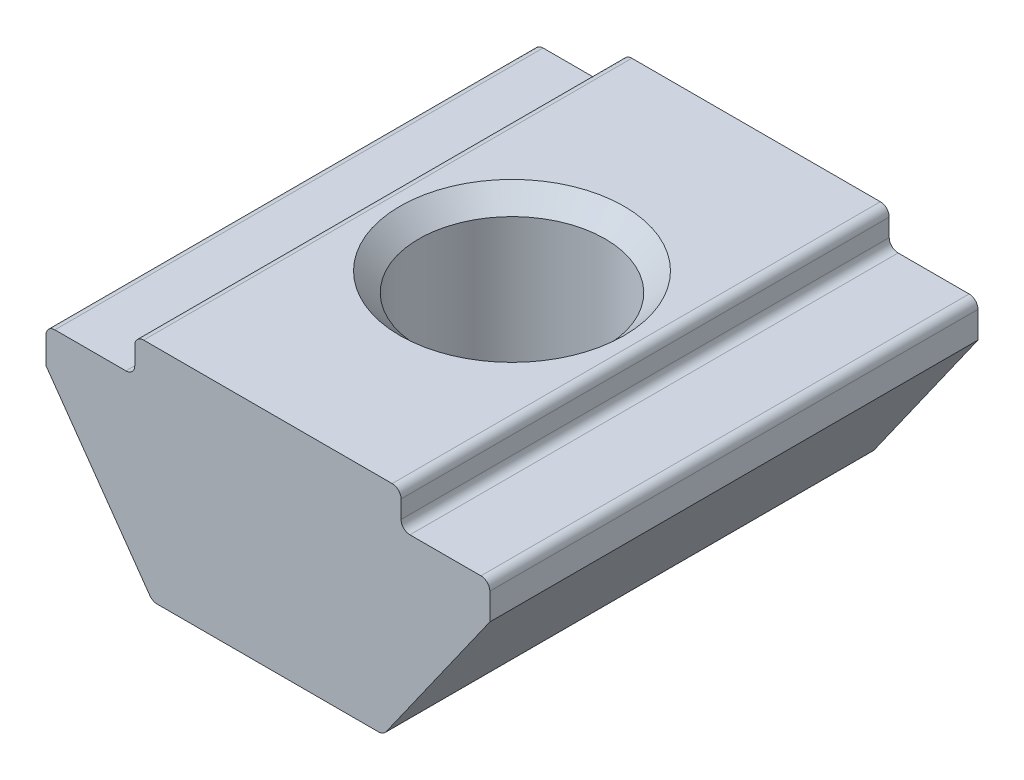
ISO-10303-21;
HEADER;
FILE_DESCRIPTION(('STEP AP214'),'2;1');
FILE_NAME('part.step','',(''),(''),'','','');
FILE_SCHEMA(('AUTOMOTIVE_DESIGN { 1 0 10303 214 1 1 1 1 }'));
ENDSEC;
DATA;
#1=APPLICATION_CONTEXT('core data for automotive mechanical design processes');
#2=APPLICATION_PROTOCOL_DEFINITION('international standard','automotive_design',2000,#1);
#3=PRODUCT_CONTEXT('',#1,'mechanical');
#4=PRODUCT('Part','Part','',(#3));
#5=PRODUCT_RELATED_PRODUCT_CATEGORY('part','',(#4));
#6=PRODUCT_DEFINITION_FORMATION('','',#4);
#7=PRODUCT_DEFINITION_CONTEXT('part definition',#1,'design');
#8=PRODUCT_DEFINITION('design','',#6,#7);
#9=PRODUCT_DEFINITION_SHAPE('','',#8);
#10=(LENGTH_UNIT() NAMED_UNIT(*) SI_UNIT(.MILLI.,.METRE.));
#11=(NAMED_UNIT(*) PLANE_ANGLE_UNIT() SI_UNIT($,.RADIAN.));
#12=(NAMED_UNIT(*) SI_UNIT($,.STERADIAN.) SOLID_ANGLE_UNIT());
#13=UNCERTAINTY_MEASURE_WITH_UNIT(LENGTH_MEASURE(1.E-05),#10,'distance_accuracy_value','');
#14=(GEOMETRIC_REPRESENTATION_CONTEXT(3) GLOBAL_UNCERTAINTY_ASSIGNED_CONTEXT((#13)) GLOBAL_UNIT_ASSIGNED_CONTEXT((#10,
#11,#12)) REPRESENTATION_CONTEXT('',''));
#15=CARTESIAN_POINT('',(0.,0.,0.));
#16=DIRECTION('',(0.,0.,1.));
#17=DIRECTION('',(1.,0.,0.));
#18=AXIS2_PLACEMENT_3D('',#15,#16,#17);
#19=CARTESIAN_POINT('',(-2.6,-5.,5.5));
#20=DIRECTION('',(0.,1.,0.));
#21=DIRECTION('',(0.,0.,1.));
#22=AXIS2_PLACEMENT_3D('',#19,#20,#21);
#23=PLANE('',#22);
#24=DIRECTION('',(1.,0.,0.));
#25=VECTOR('',#24,1.);
#26=CARTESIAN_POINT('',(-2.6,-5.,-5.5));
#27=LINE('',#26,#25);
#28=CARTESIAN_POINT('',(-2.49636879945077,-5.,-5.5));
#29=VERTEX_POINT('',#28);
#30=CARTESIAN_POINT('',(2.49636879945077,-5.,-5.5));
#31=VERTEX_POINT('',#30);
#32=EDGE_CURVE('E230',#29,#31,#27,.T.);
#33=ORIENTED_EDGE('',*,*,#32,.T.);
#34=DIRECTION('',(0.,0.,-1.));
#35=VECTOR('',#34,1.);
#36=CARTESIAN_POINT('',(2.49636879945077,-5.,5.5));
#37=LINE('',#36,#35);
#38=CARTESIAN_POINT('',(2.49636879945077,-5.,-0.37916726800811));
#39=VERTEX_POINT('',#38);
#40=EDGE_CURVE('E270',#31,#39,#37,.F.);
#41=ORIENTED_EDGE('',*,*,#40,.T.);
#42=CARTESIAN_POINT('',(0.,-5.,0.));
#43=DIRECTION('',(0.,1.,0.));
#44=DIRECTION('',(0.,0.,1.));
#45=AXIS2_PLACEMENT_3D('',#42,#43,#44);
#46=CIRCLE('',#45,2.525);
#47=CARTESIAN_POINT('',(-2.49636879945077,-5.,-0.379167268008107));
#48=VERTEX_POINT('',#47);
#49=EDGE_CURVE('E432',#39,#48,#46,.T.);
#50=ORIENTED_EDGE('',*,*,#49,.T.);
#51=DIRECTION('',(0.,0.,-1.));
#52=VECTOR('',#51,1.);
#53=CARTESIAN_POINT('',(-2.49636879945077,-5.,5.5));
#54=LINE('',#53,#52);
#55=EDGE_CURVE('E263',#48,#29,#54,.T.);
#56=ORIENTED_EDGE('',*,*,#55,.T.);
#57=EDGE_LOOP('',(#33,#41,#50,#56));
#58=FACE_BOUND('',#57,.T.);
#59=ADVANCED_FACE('F37',(#58),#23,.F.);
#60=CARTESIAN_POINT('',(-3.00000000000001,0.,5.5));
#61=DIRECTION('',(1.,0.,0.));
#62=DIRECTION('',(0.,1.,0.));
#63=AXIS2_PLACEMENT_3D('',#60,#61,#62);
#64=PLANE('',#63);
#65=DIRECTION('',(0.,-1.,0.));
#66=VECTOR('',#65,1.);
#67=CARTESIAN_POINT('',(-3.00000000000001,0.,5.5));
#68=LINE('',#67,#66);
#69=CARTESIAN_POINT('',(-3.,-0.200000000000002,5.5));
#70=VERTEX_POINT('',#69);
#71=CARTESIAN_POINT('',(-3.,-0.599999999999998,5.5));
#72=VERTEX_POINT('',#71);
#73=EDGE_CURVE('E246',#70,#72,#68,.T.);
#74=ORIENTED_EDGE('',*,*,#73,.F.);
#75=DIRECTION('',(0.,0.,-1.));
#76=VECTOR('',#75,1.);
#77=CARTESIAN_POINT('',(-3.,-0.200000000000002,5.5));
#78=LINE('',#77,#76);
#79=CARTESIAN_POINT('',(-3.,-0.200000000000002,-5.5));
#80=VERTEX_POINT('',#79);
#81=EDGE_CURVE('E397',#70,#80,#78,.T.);
#82=ORIENTED_EDGE('',*,*,#81,.T.);
#83=DIRECTION('',(0.,-1.,0.));
#84=VECTOR('',#83,1.);
#85=CARTESIAN_POINT('',(-3.00000000000001,0.,-5.5));
#86=LINE('',#85,#84);
#87=CARTESIAN_POINT('',(-3.,-0.599999999999998,-5.5));
#88=VERTEX_POINT('',#87);
#89=EDGE_CURVE('E220',#80,#88,#86,.T.);
#90=ORIENTED_EDGE('',*,*,#89,.T.);
#91=DIRECTION('',(0.,0.,-1.));
#92=VECTOR('',#91,1.);
#93=CARTESIAN_POINT('',(-3.,-0.599999999999998,5.5));
#94=LINE('',#93,#92);
#95=EDGE_CURVE('E395',#88,#72,#94,.F.);
#96=ORIENTED_EDGE('',*,*,#95,.T.);
#97=EDGE_LOOP('',(#74,#82,#90,#96));
#98=FACE_BOUND('',#97,.T.);
#99=ADVANCED_FACE('F336',(#98),#64,.F.);
#100=CARTESIAN_POINT('',(-3.,-0.799999999999999,5.5));
#101=DIRECTION('',(0.,-1.,0.));
#102=DIRECTION('',(1.,0.,0.));
#103=AXIS2_PLACEMENT_3D('',#100,#101,#102);
#104=PLANE('',#103);
#105=DIRECTION('',(-1.,0.,0.));
#106=VECTOR('',#105,1.);
#107=CARTESIAN_POINT('',(-3.,-0.799999999999999,-5.5));
#108=LINE('',#107,#106);
#109=CARTESIAN_POINT('',(-3.2,-0.799999999999999,-5.5));
#110=VERTEX_POINT('',#109);
#111=CARTESIAN_POINT('',(-4.8,-0.8,-5.5));
#112=VERTEX_POINT('',#111);
#113=EDGE_CURVE('E223',#110,#112,#108,.T.);
#114=ORIENTED_EDGE('',*,*,#113,.T.);
#115=DIRECTION('',(0.,0.,-1.));
#116=VECTOR('',#115,1.);
#117=CARTESIAN_POINT('',(-4.8,-0.8,5.5));
#118=LINE('',#117,#116);
#119=CARTESIAN_POINT('',(-4.8,-0.8,5.5));
#120=VERTEX_POINT('',#119);
#121=EDGE_CURVE('E405',#112,#120,#118,.F.);
#122=ORIENTED_EDGE('',*,*,#121,.T.);
#123=DIRECTION('',(-1.,0.,0.));
#124=VECTOR('',#123,1.);
#125=CARTESIAN_POINT('',(-3.,-0.799999999999999,5.5));
#126=LINE('',#125,#124);
#127=CARTESIAN_POINT('',(-3.2,-0.799999999999999,5.5));
#128=VERTEX_POINT('',#127);
#129=EDGE_CURVE('E187',#128,#120,#126,.T.);
#130=ORIENTED_EDGE('',*,*,#129,.F.);
#131=DIRECTION('',(0.,0.,-1.));
#132=VECTOR('',#131,1.);
#133=CARTESIAN_POINT('',(-3.2,-0.799999999999999,-5.5));
#134=LINE('',#133,#132);
#135=EDGE_CURVE('E402',#128,#110,#134,.T.);
#136=ORIENTED_EDGE('',*,*,#135,.T.);
#137=EDGE_LOOP('',(#114,#122,#130,#136));
#138=FACE_BOUND('',#137,.T.);
#139=ADVANCED_FACE('F333',(#138),#104,.F.);
#140=CARTESIAN_POINT('',(-5.,-0.8,5.5));
#141=DIRECTION('',(1.,0.,0.));
#142=DIRECTION('',(0.,0.,-1.));
#143=AXIS2_PLACEMENT_3D('',#140,#141,#142);
#144=PLANE('',#143);
#145=DIRECTION('',(0.,-1.,0.));
#146=VECTOR('',#145,1.);
#147=CARTESIAN_POINT('',(-5.,-0.8,5.5));
#148=LINE('',#147,#146);
#149=CARTESIAN_POINT('',(-5.,-1.,5.5));
#150=VERTEX_POINT('',#149);
#151=CARTESIAN_POINT('',(-5.,-1.6,5.5));
#152=VERTEX_POINT('',#151);
#153=EDGE_CURVE('E174',#150,#152,#148,.T.);
#154=ORIENTED_EDGE('',*,*,#153,.F.);
#155=DIRECTION('',(0.,0.,-1.));
#156=VECTOR('',#155,1.);
#157=CARTESIAN_POINT('',(-5.,-1.,5.5));
#158=LINE('',#157,#156);
#159=CARTESIAN_POINT('',(-5.,-1.,-5.5));
#160=VERTEX_POINT('',#159);
#161=EDGE_CURVE('E400',#150,#160,#158,.T.);
#162=ORIENTED_EDGE('',*,*,#161,.T.);
#163=DIRECTION('',(0.,-1.,0.));
#164=VECTOR('',#163,1.);
#165=CARTESIAN_POINT('',(-5.,-0.8,-5.5));
#166=LINE('',#165,#164);
#167=CARTESIAN_POINT('',(-5.,-1.6,-5.5));
#168=VERTEX_POINT('',#167);
#169=EDGE_CURVE('E193',#160,#168,#166,.T.);
#170=ORIENTED_EDGE('',*,*,#169,.T.);
#171=DIRECTION('',(0.,0.,-1.));
#172=VECTOR('',#171,1.);
#173=CARTESIAN_POINT('',(-5.,-1.6,5.5));
#174=LINE('',#173,#172);
#175=EDGE_CURVE('E190',#152,#168,#174,.T.);
#176=ORIENTED_EDGE('',*,*,#175,.F.);
#177=EDGE_LOOP('',(#154,#162,#170,#176));
#178=FACE_BOUND('',#177,.T.);
#179=ADVANCED_FACE('F191',(#178),#144,.F.);
#180=CARTESIAN_POINT('',(-5.,-1.6,5.5));
#181=DIRECTION('',(0.816967863264762,0.576683197598655,0.));
#182=DIRECTION('',(-0.576683197598655,0.816967863264762,0.));
#183=AXIS2_PLACEMENT_3D('',#180,#181,#182);
#184=PLANE('',#183);
#185=DIRECTION('',(0.576683197598655,-0.816967863264762,0.));
#186=VECTOR('',#185,1.);
#187=CARTESIAN_POINT('',(-5.,-1.6,-5.5));
#188=LINE('',#187,#186);
#189=CARTESIAN_POINT('',(-2.65976237210372,-4.91533663951973,-5.5));
#190=VERTEX_POINT('',#189);
#191=EDGE_CURVE('E228',#168,#190,#188,.T.);
#192=ORIENTED_EDGE('',*,*,#191,.T.);
#193=DIRECTION('',(0.,0.,-1.));
#194=VECTOR('',#193,1.);
#195=CARTESIAN_POINT('',(-2.65976237210372,-4.91533663951973,5.5));
#196=LINE('',#195,#194);
#197=CARTESIAN_POINT('',(-2.65976237210372,-4.91533663951973,5.5));
#198=VERTEX_POINT('',#197);
#199=EDGE_CURVE('E202',#190,#198,#196,.F.);
#200=ORIENTED_EDGE('',*,*,#199,.T.);
#201=DIRECTION('',(0.576683197598655,-0.816967863264762,0.));
#202=VECTOR('',#201,1.);
#203=CARTESIAN_POINT('',(-5.,-1.6,5.5));
#204=LINE('',#203,#202);
#205=EDGE_CURVE('E179',#152,#198,#204,.T.);
#206=ORIENTED_EDGE('',*,*,#205,.F.);
#207=ORIENTED_EDGE('',*,*,#175,.T.);
#208=EDGE_LOOP('',(#192,#200,#206,#207));
#209=FACE_BOUND('',#208,.T.);
#210=ADVANCED_FACE('F200',(#209),#184,.F.);
#211=CARTESIAN_POINT('',(-2.49636879945077,-5.,0.379167268008107));
#212=VERTEX_POINT('',#211);
#213=CARTESIAN_POINT('',(2.49636879945077,-5.,0.37916726800811));
#214=VERTEX_POINT('',#213);
#215=EDGE_CURVE('E433',#212,#214,#46,.T.);
#216=ORIENTED_EDGE('',*,*,#215,.T.);
#217=DIRECTION('',(0.,0.,-1.));
#218=VECTOR('',#217,1.);
#219=CARTESIAN_POINT('',(2.49636879945077,-5.,5.5));
#220=LINE('',#219,#218);
#221=CARTESIAN_POINT('',(2.49636879945077,-5.,5.5));
#222=VERTEX_POINT('',#221);
#223=EDGE_CURVE('E268',#214,#222,#220,.F.);
#224=ORIENTED_EDGE('',*,*,#223,.T.);
#225=DIRECTION('',(1.,0.,0.));
#226=VECTOR('',#225,1.);
#227=CARTESIAN_POINT('',(-2.6,-5.,5.5));
#228=LINE('',#227,#226);
#229=CARTESIAN_POINT('',(-2.49636879945077,-5.,5.5));
#230=VERTEX_POINT('',#229);
#231=EDGE_CURVE('E203',#230,#222,#228,.T.);
#232=ORIENTED_EDGE('',*,*,#231,.F.);
#233=DIRECTION('',(0.,0.,-1.));
#234=VECTOR('',#233,1.);
#235=CARTESIAN_POINT('',(-2.49636879945077,-5.,5.5));
#236=LINE('',#235,#234);
#237=EDGE_CURVE('E265',#230,#212,#236,.T.);
#238=ORIENTED_EDGE('',*,*,#237,.T.);
#239=EDGE_LOOP('',(#216,#224,#232,#238));
#240=FACE_BOUND('',#239,.T.);
#241=ADVANCED_FACE('F324',(#240),#23,.F.);
#242=CARTESIAN_POINT('',(5.,-1.6,5.5));
#243=DIRECTION('',(-0.816967863264762,0.576683197598655,0.));
#244=DIRECTION('',(-0.576683197598655,-0.816967863264762,0.));
#245=AXIS2_PLACEMENT_3D('',#242,#243,#244);
#246=PLANE('',#245);
#247=DIRECTION('',(0.576683197598655,0.816967863264762,0.));
#248=VECTOR('',#247,1.);
#249=CARTESIAN_POINT('',(5.,-1.6,5.5));
#250=LINE('',#249,#248);
#251=CARTESIAN_POINT('',(2.65976237210372,-4.91533663951973,5.5));
#252=VERTEX_POINT('',#251);
#253=CARTESIAN_POINT('',(5.,-1.6,5.5));
#254=VERTEX_POINT('',#253);
#255=EDGE_CURVE('E205',#252,#254,#250,.T.);
#256=ORIENTED_EDGE('',*,*,#255,.F.);
#257=DIRECTION('',(0.,0.,-1.));
#258=VECTOR('',#257,1.);
#259=CARTESIAN_POINT('',(2.65976237210372,-4.91533663951973,5.5));
#260=LINE('',#259,#258);
#261=CARTESIAN_POINT('',(2.65976237210372,-4.91533663951973,-5.5));
#262=VERTEX_POINT('',#261);
#263=EDGE_CURVE('E197',#252,#262,#260,.T.);
#264=ORIENTED_EDGE('',*,*,#263,.T.);
#265=DIRECTION('',(0.576683197598655,0.816967863264762,0.));
#266=VECTOR('',#265,1.);
#267=CARTESIAN_POINT('',(5.,-1.6,-5.5));
#268=LINE('',#267,#266);
#269=CARTESIAN_POINT('',(5.,-1.6,-5.5));
#270=VERTEX_POINT('',#269);
#271=EDGE_CURVE('E233',#262,#270,#268,.T.);
#272=ORIENTED_EDGE('',*,*,#271,.T.);
#273=DIRECTION('',(0.,0.,-1.));
#274=VECTOR('',#273,1.);
#275=CARTESIAN_POINT('',(5.,-1.6,5.5));
#276=LINE('',#275,#274);
#277=EDGE_CURVE('E198',#254,#270,#276,.T.);
#278=ORIENTED_EDGE('',*,*,#277,.F.);
#279=EDGE_LOOP('',(#256,#264,#272,#278));
#280=FACE_BOUND('',#279,.T.);
#281=ADVANCED_FACE('F320',(#280),#246,.F.);
#282=CARTESIAN_POINT('',(5.,-0.8,5.5));
#283=DIRECTION('',(-1.,0.,0.));
#284=DIRECTION('',(0.,0.,1.));
#285=AXIS2_PLACEMENT_3D('',#282,#283,#284);
#286=PLANE('',#285);
#287=DIRECTION('',(0.,1.,0.));
#288=VECTOR('',#287,1.);
#289=CARTESIAN_POINT('',(5.,-0.8,-5.5));
#290=LINE('',#289,#288);
#291=CARTESIAN_POINT('',(5.,-1.,-5.5));
#292=VERTEX_POINT('',#291);
#293=EDGE_CURVE('E235',#270,#292,#290,.T.);
#294=ORIENTED_EDGE('',*,*,#293,.T.);
#295=DIRECTION('',(0.,0.,-1.));
#296=VECTOR('',#295,1.);
#297=CARTESIAN_POINT('',(5.,-1.,5.5));
#298=LINE('',#297,#296);
#299=CARTESIAN_POINT('',(5.,-1.,5.5));
#300=VERTEX_POINT('',#299);
#301=EDGE_CURVE('E384',#292,#300,#298,.F.);
#302=ORIENTED_EDGE('',*,*,#301,.T.);
#303=DIRECTION('',(0.,1.,0.));
#304=VECTOR('',#303,1.);
#305=CARTESIAN_POINT('',(5.,-0.8,5.5));
#306=LINE('',#305,#304);
#307=EDGE_CURVE('E210',#254,#300,#306,.T.);
#308=ORIENTED_EDGE('',*,*,#307,.F.);
#309=ORIENTED_EDGE('',*,*,#277,.T.);
#310=EDGE_LOOP('',(#294,#302,#308,#309));
#311=FACE_BOUND('',#310,.T.);
#312=ADVANCED_FACE('F316',(#311),#286,.F.);
#313=CARTESIAN_POINT('',(3.,-0.799999999999999,5.5));
#314=DIRECTION('',(0.,-1.,0.));
#315=DIRECTION('',(1.,0.,0.));
#316=AXIS2_PLACEMENT_3D('',#313,#314,#315);
#317=PLANE('',#316);
#318=DIRECTION('',(-1.,0.,0.));
#319=VECTOR('',#318,1.);
#320=CARTESIAN_POINT('',(3.,-0.799999999999999,5.5));
#321=LINE('',#320,#319);
#322=CARTESIAN_POINT('',(4.8,-0.8,5.5));
#323=VERTEX_POINT('',#322);
#324=CARTESIAN_POINT('',(3.2,-0.799999999999999,5.5));
#325=VERTEX_POINT('',#324);
#326=EDGE_CURVE('E213',#323,#325,#321,.T.);
#327=ORIENTED_EDGE('',*,*,#326,.F.);
#328=DIRECTION('',(0.,0.,-1.));
#329=VECTOR('',#328,1.);
#330=CARTESIAN_POINT('',(4.8,-0.8,5.5));
#331=LINE('',#330,#329);
#332=CARTESIAN_POINT('',(4.8,-0.8,-5.5));
#333=VERTEX_POINT('',#332);
#334=EDGE_CURVE('E381',#323,#333,#331,.T.);
#335=ORIENTED_EDGE('',*,*,#334,.T.);
#336=DIRECTION('',(-1.,0.,0.));
#337=VECTOR('',#336,1.);
#338=CARTESIAN_POINT('',(3.,-0.799999999999999,-5.5));
#339=LINE('',#338,#337);
#340=CARTESIAN_POINT('',(3.2,-0.799999999999999,-5.5));
#341=VERTEX_POINT('',#340);
#342=EDGE_CURVE('E238',#333,#341,#339,.T.);
#343=ORIENTED_EDGE('',*,*,#342,.T.);
#344=DIRECTION('',(0.,0.,-1.));
#345=VECTOR('',#344,1.);
#346=CARTESIAN_POINT('',(3.2,-0.799999999999999,5.5));
#347=LINE('',#346,#345);
#348=EDGE_CURVE('E379',#341,#325,#347,.F.);
#349=ORIENTED_EDGE('',*,*,#348,.T.);
#350=EDGE_LOOP('',(#327,#335,#343,#349));
#351=FACE_BOUND('',#350,.T.);
#352=ADVANCED_FACE('F312',(#351),#317,.F.);
#353=CARTESIAN_POINT('',(3.00000000000001,0.,5.5));
#354=DIRECTION('',(-1.,0.,0.));
#355=DIRECTION('',(0.,-1.,0.));
#356=AXIS2_PLACEMENT_3D('',#353,#354,#355);
#357=PLANE('',#356);
#358=DIRECTION('',(0.,1.,0.));
#359=VECTOR('',#358,1.);
#360=CARTESIAN_POINT('',(3.00000000000001,0.,5.5));
#361=LINE('',#360,#359);
#362=CARTESIAN_POINT('',(3.,-0.599999999999998,5.5));
#363=VERTEX_POINT('',#362);
#364=CARTESIAN_POINT('',(3.,-0.200000000000002,5.5));
#365=VERTEX_POINT('',#364);
#366=EDGE_CURVE('E216',#363,#365,#361,.T.);
#367=ORIENTED_EDGE('',*,*,#366,.F.);
#368=DIRECTION('',(0.,0.,-1.));
#369=VECTOR('',#368,1.);
#370=CARTESIAN_POINT('',(3.,-0.599999999999998,-5.5));
#371=LINE('',#370,#369);
#372=CARTESIAN_POINT('',(3.,-0.599999999999998,-5.5));
#373=VERTEX_POINT('',#372);
#374=EDGE_CURVE('E388',#363,#373,#371,.T.);
#375=ORIENTED_EDGE('',*,*,#374,.T.);
#376=DIRECTION('',(0.,1.,0.));
#377=VECTOR('',#376,1.);
#378=CARTESIAN_POINT('',(3.00000000000001,0.,-5.5));
#379=LINE('',#378,#377);
#380=CARTESIAN_POINT('',(3.,-0.200000000000002,-5.5));
#381=VERTEX_POINT('',#380);
#382=EDGE_CURVE('E241',#373,#381,#379,.T.);
#383=ORIENTED_EDGE('',*,*,#382,.T.);
#384=DIRECTION('',(0.,0.,-1.));
#385=VECTOR('',#384,1.);
#386=CARTESIAN_POINT('',(3.,-0.200000000000002,5.5));
#387=LINE('',#386,#385);
#388=EDGE_CURVE('E386',#381,#365,#387,.F.);
#389=ORIENTED_EDGE('',*,*,#388,.T.);
#390=EDGE_LOOP('',(#367,#375,#383,#389));
#391=FACE_BOUND('',#390,.T.);
#392=ADVANCED_FACE('F308',(#391),#357,.F.);
#393=CARTESIAN_POINT('',(3.00000000000001,0.,5.5));
#394=DIRECTION('',(0.,-1.,0.));
#395=DIRECTION('',(0.,0.,-1.));
#396=AXIS2_PLACEMENT_3D('',#393,#394,#395);
#397=PLANE('',#396);
#398=CARTESIAN_POINT('',(0.,0.,0.));
#399=DIRECTION('',(0.,1.,0.));
#400=DIRECTION('',(0.,0.,1.));
#401=AXIS2_PLACEMENT_3D('',#398,#399,#400);
#402=CIRCLE('',#401,2.525);
#403=CARTESIAN_POINT('',(0.,0.,2.525));
#404=VERTEX_POINT('',#403);
#405=EDGE_CURVE('E429',#404,#404,#402,.T.);
#406=ORIENTED_EDGE('',*,*,#405,.F.);
#407=EDGE_LOOP('',(#406));
#408=FACE_BOUND('',#407,.T.);
#409=DIRECTION('',(-1.,0.,0.));
#410=VECTOR('',#409,1.);
#411=CARTESIAN_POINT('',(3.00000000000001,0.,5.5));
#412=LINE('',#411,#410);
#413=CARTESIAN_POINT('',(2.8,0.,5.5));
#414=VERTEX_POINT('',#413);
#415=CARTESIAN_POINT('',(-2.8,0.,5.5));
#416=VERTEX_POINT('',#415);
#417=EDGE_CURVE('E218',#414,#416,#412,.T.);
#418=ORIENTED_EDGE('',*,*,#417,.F.);
#419=DIRECTION('',(0.,0.,-1.));
#420=VECTOR('',#419,1.);
#421=CARTESIAN_POINT('',(2.8,0.,5.5));
#422=LINE('',#421,#420);
#423=CARTESIAN_POINT('',(2.8,0.,-5.5));
#424=VERTEX_POINT('',#423);
#425=EDGE_CURVE('E392',#414,#424,#422,.T.);
#426=ORIENTED_EDGE('',*,*,#425,.T.);
#427=DIRECTION('',(-1.,0.,0.));
#428=VECTOR('',#427,1.);
#429=CARTESIAN_POINT('',(3.00000000000001,0.,-5.5));
#430=LINE('',#429,#428);
#431=CARTESIAN_POINT('',(-2.8,0.,-5.5));
#432=VERTEX_POINT('',#431);
#433=EDGE_CURVE('E244',#424,#432,#430,.T.);
#434=ORIENTED_EDGE('',*,*,#433,.T.);
#435=DIRECTION('',(0.,0.,-1.));
#436=VECTOR('',#435,1.);
#437=CARTESIAN_POINT('',(-2.80000000000001,0.,5.5));
#438=LINE('',#437,#436);
#439=EDGE_CURVE('E52',#432,#416,#438,.F.);
#440=ORIENTED_EDGE('',*,*,#439,.T.);
#441=EDGE_LOOP('',(#418,#426,#434,#440));
#442=FACE_BOUND('',#441,.T.);
#443=ADVANCED_FACE('F302',(#408,#442),#397,.F.);
#444=CARTESIAN_POINT('',(0.,0.,5.5));
#445=DIRECTION('',(0.,0.,-1.));
#446=DIRECTION('',(-1.,0.,0.));
#447=AXIS2_PLACEMENT_3D('',#444,#445,#446);
#448=PLANE('',#447);
#449=ORIENTED_EDGE('',*,*,#231,.T.);
#450=CARTESIAN_POINT('',(2.49636879945077,-4.8,5.5));
#451=DIRECTION('',(0.,0.,-1.));
#452=DIRECTION('',(-1.,0.,0.));
#453=AXIS2_PLACEMENT_3D('',#450,#451,#452);
#454=CIRCLE('',#453,0.2);
#455=EDGE_CURVE('E376',#222,#252,#454,.F.);
#456=ORIENTED_EDGE('',*,*,#455,.T.);
#457=ORIENTED_EDGE('',*,*,#255,.T.);
#458=ORIENTED_EDGE('',*,*,#307,.T.);
#459=CARTESIAN_POINT('',(4.8,-1.,5.5));
#460=DIRECTION('',(0.,0.,-1.));
#461=DIRECTION('',(-1.,0.,0.));
#462=AXIS2_PLACEMENT_3D('',#459,#460,#461);
#463=CIRCLE('',#462,0.2);
#464=EDGE_CURVE('E372',#300,#323,#463,.F.);
#465=ORIENTED_EDGE('',*,*,#464,.T.);
#466=ORIENTED_EDGE('',*,*,#326,.T.);
#467=CARTESIAN_POINT('',(3.2,-0.6,5.5));
#468=DIRECTION('',(0.,0.,-1.));
#469=DIRECTION('',(-1.,0.,0.));
#470=AXIS2_PLACEMENT_3D('',#467,#468,#469);
#471=CIRCLE('',#470,0.2);
#472=EDGE_CURVE('E409',#325,#363,#471,.T.);
#473=ORIENTED_EDGE('',*,*,#472,.T.);
#474=ORIENTED_EDGE('',*,*,#366,.T.);
#475=CARTESIAN_POINT('',(2.8,-0.2,5.5));
#476=DIRECTION('',(0.,0.,-1.));
#477=DIRECTION('',(-1.,0.,0.));
#478=AXIS2_PLACEMENT_3D('',#475,#476,#477);
#479=CIRCLE('',#478,0.2);
#480=EDGE_CURVE('E59',#365,#414,#479,.F.);
#481=ORIENTED_EDGE('',*,*,#480,.T.);
#482=ORIENTED_EDGE('',*,*,#417,.T.);
#483=CARTESIAN_POINT('',(-2.8,-0.2,5.5));
#484=DIRECTION('',(0.,0.,-1.));
#485=DIRECTION('',(-1.,0.,0.));
#486=AXIS2_PLACEMENT_3D('',#483,#484,#485);
#487=CIRCLE('',#486,0.2);
#488=EDGE_CURVE('E368',#416,#70,#487,.F.);
#489=ORIENTED_EDGE('',*,*,#488,.T.);
#490=ORIENTED_EDGE('',*,*,#73,.T.);
#491=CARTESIAN_POINT('',(-3.2,-0.6,5.5));
#492=DIRECTION('',(0.,0.,-1.));
#493=DIRECTION('',(-1.,0.,0.));
#494=AXIS2_PLACEMENT_3D('',#491,#492,#493);
#495=CIRCLE('',#494,0.2);
#496=EDGE_CURVE('E11',#72,#128,#495,.T.);
#497=ORIENTED_EDGE('',*,*,#496,.T.);
#498=ORIENTED_EDGE('',*,*,#129,.T.);
#499=CARTESIAN_POINT('',(-4.8,-1.,5.5));
#500=DIRECTION('',(0.,0.,-1.));
#501=DIRECTION('',(-1.,0.,0.));
#502=AXIS2_PLACEMENT_3D('',#499,#500,#501);
#503=CIRCLE('',#502,0.2);
#504=EDGE_CURVE('E183',#120,#150,#503,.F.);
#505=ORIENTED_EDGE('',*,*,#504,.T.);
#506=ORIENTED_EDGE('',*,*,#153,.T.);
#507=ORIENTED_EDGE('',*,*,#205,.T.);
#508=CARTESIAN_POINT('',(-2.49636879945077,-4.8,5.5));
#509=DIRECTION('',(0.,0.,-1.));
#510=DIRECTION('',(-1.,0.,0.));
#511=AXIS2_PLACEMENT_3D('',#508,#509,#510);
#512=CIRCLE('',#511,0.2);
#513=EDGE_CURVE('E374',#198,#230,#512,.F.);
#514=ORIENTED_EDGE('',*,*,#513,.T.);
#515=EDGE_LOOP('',(#449,#456,#457,#458,#465,#466,#473,#474,#481,#482,#489,#490,#497,#498,#505,
#506,#507,#514));
#516=FACE_BOUND('',#515,.T.);
#517=ADVANCED_FACE('F177',(#516),#448,.F.);
#518=CARTESIAN_POINT('',(0.,0.,-5.5));
#519=DIRECTION('',(0.,0.,-1.));
#520=DIRECTION('',(-1.,0.,0.));
#521=AXIS2_PLACEMENT_3D('',#518,#519,#520);
#522=PLANE('',#521);
#523=ORIENTED_EDGE('',*,*,#271,.F.);
#524=CARTESIAN_POINT('',(2.49636879945077,-4.8,-5.5));
#525=DIRECTION('',(0.,0.,-1.));
#526=DIRECTION('',(-1.,0.,0.));
#527=AXIS2_PLACEMENT_3D('',#524,#525,#526);
#528=CIRCLE('',#527,0.2);
#529=EDGE_CURVE('E261',#262,#31,#528,.T.);
#530=ORIENTED_EDGE('',*,*,#529,.T.);
#531=ORIENTED_EDGE('',*,*,#32,.F.);
#532=CARTESIAN_POINT('',(-2.49636879945077,-4.8,-5.5));
#533=DIRECTION('',(0.,0.,-1.));
#534=DIRECTION('',(-1.,0.,0.));
#535=AXIS2_PLACEMENT_3D('',#532,#533,#534);
#536=CIRCLE('',#535,0.2);
#537=EDGE_CURVE('E259',#29,#190,#536,.T.);
#538=ORIENTED_EDGE('',*,*,#537,.T.);
#539=ORIENTED_EDGE('',*,*,#191,.F.);
#540=ORIENTED_EDGE('',*,*,#169,.F.);
#541=CARTESIAN_POINT('',(-4.8,-1.,-5.5));
#542=DIRECTION('',(0.,0.,-1.));
#543=DIRECTION('',(-1.,0.,0.));
#544=AXIS2_PLACEMENT_3D('',#541,#542,#543);
#545=CIRCLE('',#544,0.2);
#546=EDGE_CURVE('E251',#160,#112,#545,.T.);
#547=ORIENTED_EDGE('',*,*,#546,.T.);
#548=ORIENTED_EDGE('',*,*,#113,.F.);
#549=CARTESIAN_POINT('',(-3.2,-0.6,-5.5));
#550=DIRECTION('',(0.,0.,-1.));
#551=DIRECTION('',(-1.,0.,0.));
#552=AXIS2_PLACEMENT_3D('',#549,#550,#551);
#553=CIRCLE('',#552,0.2);
#554=EDGE_CURVE('E45',#110,#88,#553,.F.);
#555=ORIENTED_EDGE('',*,*,#554,.T.);
#556=ORIENTED_EDGE('',*,*,#89,.F.);
#557=CARTESIAN_POINT('',(-2.8,-0.2,-5.5));
#558=DIRECTION('',(0.,0.,-1.));
#559=DIRECTION('',(-1.,0.,0.));
#560=AXIS2_PLACEMENT_3D('',#557,#558,#559);
#561=CIRCLE('',#560,0.2);
#562=EDGE_CURVE('E253',#80,#432,#561,.T.);
#563=ORIENTED_EDGE('',*,*,#562,.T.);
#564=ORIENTED_EDGE('',*,*,#433,.F.);
#565=CARTESIAN_POINT('',(2.8,-0.2,-5.5));
#566=DIRECTION('',(0.,0.,-1.));
#567=DIRECTION('',(-1.,0.,0.));
#568=AXIS2_PLACEMENT_3D('',#565,#566,#567);
#569=CIRCLE('',#568,0.2);
#570=EDGE_CURVE('E255',#424,#381,#569,.T.);
#571=ORIENTED_EDGE('',*,*,#570,.T.);
#572=ORIENTED_EDGE('',*,*,#382,.F.);
#573=CARTESIAN_POINT('',(3.2,-0.6,-5.5));
#574=DIRECTION('',(0.,0.,-1.));
#575=DIRECTION('',(-1.,0.,0.));
#576=AXIS2_PLACEMENT_3D('',#573,#574,#575);
#577=CIRCLE('',#576,0.2);
#578=EDGE_CURVE('E407',#373,#341,#577,.F.);
#579=ORIENTED_EDGE('',*,*,#578,.T.);
#580=ORIENTED_EDGE('',*,*,#342,.F.);
#581=CARTESIAN_POINT('',(4.8,-1.,-5.5));
#582=DIRECTION('',(0.,0.,-1.));
#583=DIRECTION('',(-1.,0.,0.));
#584=AXIS2_PLACEMENT_3D('',#581,#582,#583);
#585=CIRCLE('',#584,0.2);
#586=EDGE_CURVE('E257',#333,#292,#585,.T.);
#587=ORIENTED_EDGE('',*,*,#586,.T.);
#588=ORIENTED_EDGE('',*,*,#293,.F.);
#589=EDGE_LOOP('',(#523,#530,#531,#538,#539,#540,#547,#548,#555,#556,#563,#564,#571,#572,#579,
#580,#587,#588));
#590=FACE_BOUND('',#589,.T.);
#591=ADVANCED_FACE('F296',(#590),#522,.T.);
#592=CARTESIAN_POINT('',(0.,-4.575,0.));
#593=DIRECTION('',(0.,-1.,0.));
#594=DIRECTION('',(0.,0.,-1.));
#595=AXIS2_PLACEMENT_3D('',#592,#593,#594);
#596=CONICAL_SURFACE('',#595,2.1,0.785398163397447);
#597=ORIENTED_EDGE('',*,*,#49,.F.);
#598=CARTESIAN_POINT('',(2.49636879945077,-5.,-0.37916726800811));
#599=CARTESIAN_POINT('',(2.50138967960926,-4.99997692204602,-0.345958131520804));
#600=CARTESIAN_POINT('',(2.50560543112059,-4.99981146870105,-0.312637518031946));
#601=CARTESIAN_POINT('',(2.51260033820821,-4.99937692150493,-0.245855325952129));
#602=CARTESIAN_POINT('',(2.51537992871023,-4.99910785907378,-0.212393793135447));
#603=CARTESIAN_POINT('',(2.51966771335152,-4.99864818125228,-0.145567538859471));
#604=CARTESIAN_POINT('',(2.521182510144,-4.99845716116101,-0.112203232333187));
#605=CARTESIAN_POINT('',(2.52302896668861,-4.99821706269062,-0.0454397147258382));
#606=CARTESIAN_POINT('',(2.52336049141606,-4.99816800051061,-0.0120405000963199));
#607=CARTESIAN_POINT('',(2.52267158675415,-4.99826766972513,0.0810611402737631));
#608=CARTESIAN_POINT('',(2.52038074485452,-4.99860261201485,0.140762486618272));
#609=CARTESIAN_POINT('',(2.51389933022278,-4.99924114035043,0.230225388039415));
#610=CARTESIAN_POINT('',(2.51122133376381,-4.99947739240342,0.260102271758532));
#611=CARTESIAN_POINT('',(2.50470257500756,-4.99985003502286,0.319738060314783));
#612=CARTESIAN_POINT('',(2.50086144579799,-4.99998639403139,0.349496924917178));
#613=CARTESIAN_POINT('',(2.49636879945077,-5.,0.37916726800811));
#614=B_SPLINE_CURVE_WITH_KNOTS('',3,(#598,#599,#600,#601,#602,#603,#604,#605,#606,#607,#608,
#609,#610,#611,#612,#613),.UNSPECIFIED.,.F.,.F.,(4,2,2,2,2,2,2,4),(0.,0.100734908454668,
0.201439292531713,0.301614619068782,0.401801376374961,0.580893304513438,0.670867179801085,
0.760869467127301),.UNSPECIFIED.);
#615=EDGE_CURVE('E280',#39,#214,#614,.T.);
#616=ORIENTED_EDGE('',*,*,#615,.T.);
#617=ORIENTED_EDGE('',*,*,#215,.F.);
#618=CARTESIAN_POINT('',(-2.49636879945077,-5.,0.379167268008107));
#619=CARTESIAN_POINT('',(-2.50138967960927,-4.99997692204602,0.345958131520801));
#620=CARTESIAN_POINT('',(-2.50560543112059,-4.99981146870105,0.312637518031944));
#621=CARTESIAN_POINT('',(-2.51260033820821,-4.99937692150493,0.245855325952127));
#622=CARTESIAN_POINT('',(-2.51537992871023,-4.99910785907378,0.212393793135445));
#623=CARTESIAN_POINT('',(-2.51966771335152,-4.99864818125228,0.145567538859469));
#624=CARTESIAN_POINT('',(-2.521182510144,-4.99845716116101,0.112203232333185));
#625=CARTESIAN_POINT('',(-2.52302896668861,-4.99821706269062,0.0454397147258359));
#626=CARTESIAN_POINT('',(-2.52336049141606,-4.99816800051061,0.0120405000963176));
#627=CARTESIAN_POINT('',(-2.52267158675415,-4.99826766972513,-0.0810611402737645));
#628=CARTESIAN_POINT('',(-2.52038074485452,-4.99860261201485,-0.140762486618272));
#629=CARTESIAN_POINT('',(-2.51389933022278,-4.99924114035043,-0.230225388039414));
#630=CARTESIAN_POINT('',(-2.51122133376381,-4.99947739240342,-0.260102271758531));
#631=CARTESIAN_POINT('',(-2.50470257500756,-4.99985003502286,-0.319738060314781));
#632=CARTESIAN_POINT('',(-2.50086144579799,-4.99998639403139,-0.349496924917177));
#633=CARTESIAN_POINT('',(-2.49636879945077,-5.,-0.379167268008107));
#634=B_SPLINE_CURVE_WITH_KNOTS('',3,(#618,#619,#620,#621,#622,#623,#624,#625,#626,#627,#628,
#629,#630,#631,#632,#633),.UNSPECIFIED.,.F.,.F.,(4,2,2,2,2,2,2,4),(0.,0.100734908454668,
0.201439292531713,0.301614619068782,0.401801376374961,0.580893304513436,0.670867179801081,
0.760869467127297),.UNSPECIFIED.);
#635=EDGE_CURVE('E272',#212,#48,#634,.T.);
#636=ORIENTED_EDGE('',*,*,#635,.T.);
#637=EDGE_LOOP('',(#597,#616,#617,#636));
#638=FACE_BOUND('',#637,.T.);
#639=CARTESIAN_POINT('',(0.,-4.575,0.));
#640=DIRECTION('',(0.,1.,0.));
#641=DIRECTION('',(0.,0.,1.));
#642=AXIS2_PLACEMENT_3D('',#639,#640,#641);
#643=CIRCLE('',#642,2.1);
#644=CARTESIAN_POINT('',(0.,-4.575,2.1));
#645=VERTEX_POINT('',#644);
#646=EDGE_CURVE('E224',#645,#645,#643,.T.);
#647=ORIENTED_EDGE('',*,*,#646,.T.);
#648=EDGE_LOOP('',(#647));
#649=FACE_BOUND('',#648,.T.);
#650=ADVANCED_FACE('F290',(#638,#649),#596,.F.);
#651=CARTESIAN_POINT('',(0.,0.,0.));
#652=DIRECTION('',(0.,1.,0.));
#653=DIRECTION('',(0.,0.,1.));
#654=AXIS2_PLACEMENT_3D('',#651,#652,#653);
#655=CYLINDRICAL_SURFACE('',#654,2.1);
#656=ORIENTED_EDGE('',*,*,#646,.F.);
#657=EDGE_LOOP('',(#656));
#658=FACE_BOUND('',#657,.T.);
#659=CARTESIAN_POINT('',(0.,-0.425,0.));
#660=DIRECTION('',(0.,1.,0.));
#661=DIRECTION('',(0.,0.,1.));
#662=AXIS2_PLACEMENT_3D('',#659,#660,#661);
#663=CIRCLE('',#662,2.1);
#664=CARTESIAN_POINT('',(0.,-0.425,2.1));
#665=VERTEX_POINT('',#664);
#666=EDGE_CURVE('E426',#665,#665,#663,.T.);
#667=ORIENTED_EDGE('',*,*,#666,.T.);
#668=EDGE_LOOP('',(#667));
#669=FACE_BOUND('',#668,.T.);
#670=ADVANCED_FACE('F295',(#658,#669),#655,.F.);
#671=CARTESIAN_POINT('',(0.,0.,0.));
#672=DIRECTION('',(0.,1.,0.));
#673=DIRECTION('',(0.,0.,1.));
#674=AXIS2_PLACEMENT_3D('',#671,#672,#673);
#675=CONICAL_SURFACE('',#674,2.525,0.785398163397448);
#676=ORIENTED_EDGE('',*,*,#666,.F.);
#677=EDGE_LOOP('',(#676));
#678=FACE_BOUND('',#677,.T.);
#679=ORIENTED_EDGE('',*,*,#405,.T.);
#680=EDGE_LOOP('',(#679));
#681=FACE_BOUND('',#680,.T.);
#682=ADVANCED_FACE('F343',(#678,#681),#675,.F.);
#683=CARTESIAN_POINT('',(2.49636879945077,-4.8,5.5));
#684=DIRECTION('',(0.,0.,-1.));
#685=DIRECTION('',(-1.,0.,0.));
#686=AXIS2_PLACEMENT_3D('',#683,#684,#685);
#687=CYLINDRICAL_SURFACE('',#686,0.2);
#688=ORIENTED_EDGE('',*,*,#615,.F.);
#689=ORIENTED_EDGE('',*,*,#40,.F.);
#690=ORIENTED_EDGE('',*,*,#529,.F.);
#691=ORIENTED_EDGE('',*,*,#263,.F.);
#692=ORIENTED_EDGE('',*,*,#455,.F.);
#693=ORIENTED_EDGE('',*,*,#223,.F.);
#694=EDGE_LOOP('',(#688,#689,#690,#691,#692,#693));
#695=FACE_BOUND('',#694,.T.);
#696=ADVANCED_FACE('F340',(#695),#687,.T.);
#697=CARTESIAN_POINT('',(-2.49636879945077,-4.8,5.5));
#698=DIRECTION('',(0.,0.,-1.));
#699=DIRECTION('',(-1.,0.,0.));
#700=AXIS2_PLACEMENT_3D('',#697,#698,#699);
#701=CYLINDRICAL_SURFACE('',#700,0.2);
#702=ORIENTED_EDGE('',*,*,#513,.F.);
#703=ORIENTED_EDGE('',*,*,#199,.F.);
#704=ORIENTED_EDGE('',*,*,#537,.F.);
#705=ORIENTED_EDGE('',*,*,#55,.F.);
#706=ORIENTED_EDGE('',*,*,#635,.F.);
#707=ORIENTED_EDGE('',*,*,#237,.F.);
#708=EDGE_LOOP('',(#702,#703,#704,#705,#706,#707));
#709=FACE_BOUND('',#708,.T.);
#710=ADVANCED_FACE('F287',(#709),#701,.T.);
#711=CARTESIAN_POINT('',(4.8,-1.,5.5));
#712=DIRECTION('',(0.,0.,-1.));
#713=DIRECTION('',(-1.,0.,0.));
#714=AXIS2_PLACEMENT_3D('',#711,#712,#713);
#715=CYLINDRICAL_SURFACE('',#714,0.2);
#716=ORIENTED_EDGE('',*,*,#464,.F.);
#717=ORIENTED_EDGE('',*,*,#301,.F.);
#718=ORIENTED_EDGE('',*,*,#586,.F.);
#719=ORIENTED_EDGE('',*,*,#334,.F.);
#720=EDGE_LOOP('',(#716,#717,#718,#719));
#721=FACE_BOUND('',#720,.T.);
#722=ADVANCED_FACE('F349',(#721),#715,.T.);
#723=CARTESIAN_POINT('',(3.2,-0.6,5.5));
#724=DIRECTION('',(0.,0.,1.));
#725=DIRECTION('',(1.,0.,0.));
#726=AXIS2_PLACEMENT_3D('',#723,#724,#725);
#727=CYLINDRICAL_SURFACE('',#726,0.2);
#728=ORIENTED_EDGE('',*,*,#472,.F.);
#729=ORIENTED_EDGE('',*,*,#348,.F.);
#730=ORIENTED_EDGE('',*,*,#578,.F.);
#731=ORIENTED_EDGE('',*,*,#374,.F.);
#732=EDGE_LOOP('',(#728,#729,#730,#731));
#733=FACE_BOUND('',#732,.T.);
#734=ADVANCED_FACE('F449',(#733),#727,.F.);
#735=CARTESIAN_POINT('',(2.8,-0.2,5.5));
#736=DIRECTION('',(0.,0.,-1.));
#737=DIRECTION('',(-1.,0.,0.));
#738=AXIS2_PLACEMENT_3D('',#735,#736,#737);
#739=CYLINDRICAL_SURFACE('',#738,0.2);
#740=ORIENTED_EDGE('',*,*,#480,.F.);
#741=ORIENTED_EDGE('',*,*,#388,.F.);
#742=ORIENTED_EDGE('',*,*,#570,.F.);
#743=ORIENTED_EDGE('',*,*,#425,.F.);
#744=EDGE_LOOP('',(#740,#741,#742,#743));
#745=FACE_BOUND('',#744,.T.);
#746=ADVANCED_FACE('F443',(#745),#739,.T.);
#747=CARTESIAN_POINT('',(-2.8,-0.2,5.5));
#748=DIRECTION('',(0.,0.,-1.));
#749=DIRECTION('',(-1.,0.,0.));
#750=AXIS2_PLACEMENT_3D('',#747,#748,#749);
#751=CYLINDRICAL_SURFACE('',#750,0.2);
#752=ORIENTED_EDGE('',*,*,#488,.F.);
#753=ORIENTED_EDGE('',*,*,#439,.F.);
#754=ORIENTED_EDGE('',*,*,#562,.F.);
#755=ORIENTED_EDGE('',*,*,#81,.F.);
#756=EDGE_LOOP('',(#752,#753,#754,#755));
#757=FACE_BOUND('',#756,.T.);
#758=ADVANCED_FACE('F438',(#757),#751,.T.);
#759=CARTESIAN_POINT('',(-4.8,-1.,5.5));
#760=DIRECTION('',(0.,0.,-1.));
#761=DIRECTION('',(-1.,0.,0.));
#762=AXIS2_PLACEMENT_3D('',#759,#760,#761);
#763=CYLINDRICAL_SURFACE('',#762,0.2);
#764=ORIENTED_EDGE('',*,*,#504,.F.);
#765=ORIENTED_EDGE('',*,*,#121,.F.);
#766=ORIENTED_EDGE('',*,*,#546,.F.);
#767=ORIENTED_EDGE('',*,*,#161,.F.);
#768=EDGE_LOOP('',(#764,#765,#766,#767));
#769=FACE_BOUND('',#768,.T.);
#770=ADVANCED_FACE('F436',(#769),#763,.T.);
#771=CARTESIAN_POINT('',(-3.2,-0.6,5.5));
#772=DIRECTION('',(0.,0.,1.));
#773=DIRECTION('',(1.,0.,0.));
#774=AXIS2_PLACEMENT_3D('',#771,#772,#773);
#775=CYLINDRICAL_SURFACE('',#774,0.2);
#776=ORIENTED_EDGE('',*,*,#496,.F.);
#777=ORIENTED_EDGE('',*,*,#95,.F.);
#778=ORIENTED_EDGE('',*,*,#554,.F.);
#779=ORIENTED_EDGE('',*,*,#135,.F.);
#780=EDGE_LOOP('',(#776,#777,#778,#779));
#781=FACE_BOUND('',#780,.T.);
#782=ADVANCED_FACE('F39',(#781),#775,.F.);
#783=CLOSED_SHELL('',(#59,#99,#139,#179,#210,#241,#281,#312,#352,#392,#443,#517,#591,#650,#670,
#682,#696,#710,#722,#734,#746,#758,#770,#782));
#784=MANIFOLD_SOLID_BREP('B2',#783);
#785=ADVANCED_BREP_SHAPE_REPRESENTATION('',(#18,#784),#14);
#786=SHAPE_DEFINITION_REPRESENTATION(#9,#785);
ENDSEC;
END-ISO-10303-21;
